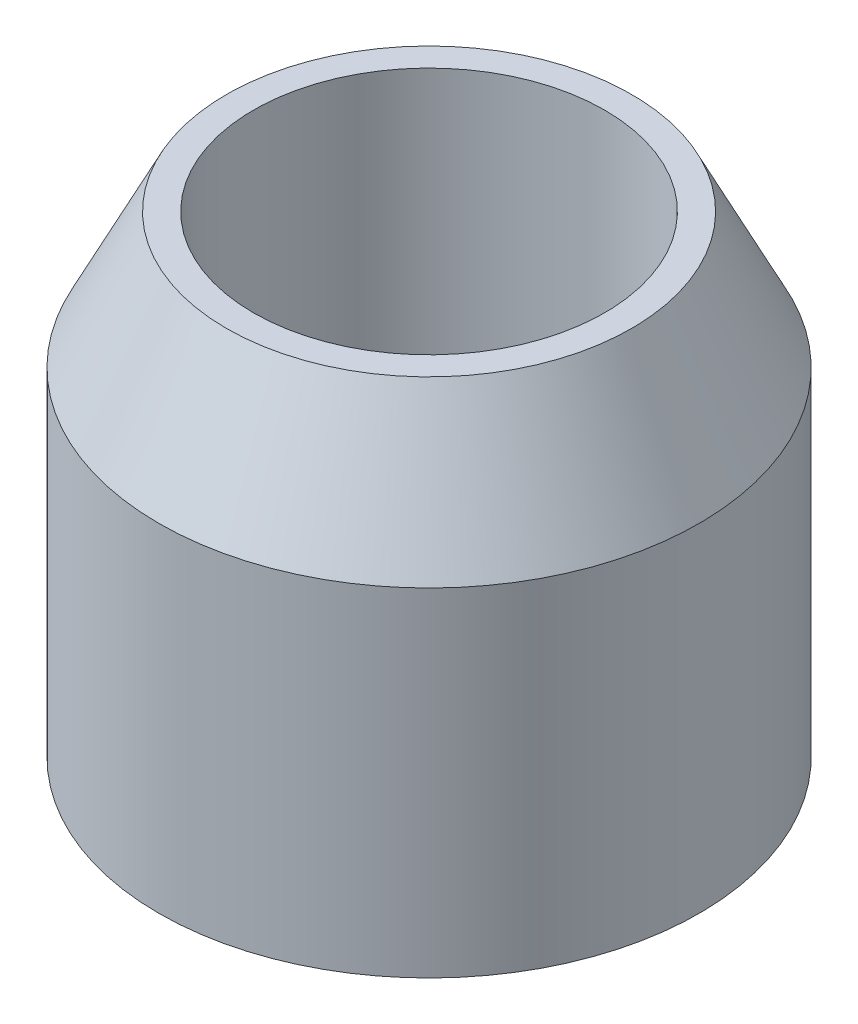
ISO-10303-21;
HEADER;
FILE_DESCRIPTION(('STEP AP214'),'2;1');
FILE_NAME('part.step','',(''),(''),'','','');
FILE_SCHEMA(('AUTOMOTIVE_DESIGN { 1 0 10303 214 1 1 1 1 }'));
ENDSEC;
DATA;
#1=APPLICATION_CONTEXT('core data for automotive mechanical design processes');
#2=APPLICATION_PROTOCOL_DEFINITION('international standard','automotive_design',2000,#1);
#3=PRODUCT_CONTEXT('',#1,'mechanical');
#4=PRODUCT('Part','Part','',(#3));
#5=PRODUCT_RELATED_PRODUCT_CATEGORY('part','',(#4));
#6=PRODUCT_DEFINITION_FORMATION('','',#4);
#7=PRODUCT_DEFINITION_CONTEXT('part definition',#1,'design');
#8=PRODUCT_DEFINITION('design','',#6,#7);
#9=PRODUCT_DEFINITION_SHAPE('','',#8);
#10=(LENGTH_UNIT() NAMED_UNIT(*) SI_UNIT(.MILLI.,.METRE.));
#11=(NAMED_UNIT(*) PLANE_ANGLE_UNIT() SI_UNIT($,.RADIAN.));
#12=(NAMED_UNIT(*) SI_UNIT($,.STERADIAN.) SOLID_ANGLE_UNIT());
#13=UNCERTAINTY_MEASURE_WITH_UNIT(LENGTH_MEASURE(1.E-05),#10,'distance_accuracy_value','');
#14=(GEOMETRIC_REPRESENTATION_CONTEXT(3) GLOBAL_UNCERTAINTY_ASSIGNED_CONTEXT((#13)) GLOBAL_UNIT_ASSIGNED_CONTEXT((#10,
#11,#12)) REPRESENTATION_CONTEXT('',''));
#15=CARTESIAN_POINT('',(0.,0.,0.));
#16=DIRECTION('',(0.,0.,1.));
#17=DIRECTION('',(1.,0.,0.));
#18=AXIS2_PLACEMENT_3D('',#15,#16,#17);
#19=CARTESIAN_POINT('',(0.,7.,0.));
#20=DIRECTION('',(0.,1.,0.));
#21=DIRECTION('',(0.,0.,1.));
#22=AXIS2_PLACEMENT_3D('',#19,#20,#21);
#23=PLANE('',#22);
#24=CARTESIAN_POINT('',(0.,7.,0.));
#25=DIRECTION('',(0.,1.,0.));
#26=DIRECTION('',(0.,0.,1.));
#27=AXIS2_PLACEMENT_3D('',#24,#25,#26);
#28=CIRCLE('',#27,3.);
#29=CARTESIAN_POINT('',(0.,7.,3.));
#30=VERTEX_POINT('',#29);
#31=EDGE_CURVE('E38',#30,#30,#28,.T.);
#32=ORIENTED_EDGE('',*,*,#31,.T.);
#33=EDGE_LOOP('',(#32));
#34=FACE_BOUND('',#33,.T.);
#35=CARTESIAN_POINT('',(0.,7.,0.));
#36=DIRECTION('',(0.,1.,0.));
#37=DIRECTION('',(0.,0.,1.));
#38=AXIS2_PLACEMENT_3D('',#35,#36,#37);
#39=CIRCLE('',#38,2.6);
#40=CARTESIAN_POINT('',(0.,7.,2.6));
#41=VERTEX_POINT('',#40);
#42=EDGE_CURVE('E46',#41,#41,#39,.T.);
#43=ORIENTED_EDGE('',*,*,#42,.F.);
#44=EDGE_LOOP('',(#43));
#45=FACE_BOUND('',#44,.T.);
#46=ADVANCED_FACE('F31',(#34,#45),#23,.T.);
#47=CARTESIAN_POINT('',(0.,0.,0.));
#48=DIRECTION('',(0.,1.,0.));
#49=DIRECTION('',(0.,0.,1.));
#50=AXIS2_PLACEMENT_3D('',#47,#48,#49);
#51=PLANE('',#50);
#52=CARTESIAN_POINT('',(0.,0.,0.));
#53=DIRECTION('',(0.,1.,0.));
#54=DIRECTION('',(0.,0.,1.));
#55=AXIS2_PLACEMENT_3D('',#52,#53,#54);
#56=CIRCLE('',#55,4.);
#57=CARTESIAN_POINT('',(0.,0.,4.));
#58=VERTEX_POINT('',#57);
#59=EDGE_CURVE('E42',#58,#58,#56,.T.);
#60=ORIENTED_EDGE('',*,*,#59,.F.);
#61=EDGE_LOOP('',(#60));
#62=FACE_BOUND('',#61,.T.);
#63=CARTESIAN_POINT('',(0.,0.,0.));
#64=DIRECTION('',(0.,1.,0.));
#65=DIRECTION('',(0.,0.,1.));
#66=AXIS2_PLACEMENT_3D('',#63,#64,#65);
#67=CIRCLE('',#66,2.6);
#68=CARTESIAN_POINT('',(0.,0.,2.6));
#69=VERTEX_POINT('',#68);
#70=EDGE_CURVE('E49',#69,#69,#67,.T.);
#71=ORIENTED_EDGE('',*,*,#70,.T.);
#72=EDGE_LOOP('',(#71));
#73=FACE_BOUND('',#72,.T.);
#74=ADVANCED_FACE('F59',(#62,#73),#51,.F.);
#75=CARTESIAN_POINT('',(0.,7.,0.));
#76=DIRECTION('',(0.,-1.,0.));
#77=DIRECTION('',(0.,0.,-1.));
#78=AXIS2_PLACEMENT_3D('',#75,#76,#77);
#79=CYLINDRICAL_SURFACE('',#78,4.);
#80=CARTESIAN_POINT('',(0.,4.99999999999999,0.));
#81=DIRECTION('',(0.,1.,0.));
#82=DIRECTION('',(0.,0.,1.));
#83=AXIS2_PLACEMENT_3D('',#80,#81,#82);
#84=CIRCLE('',#83,4.);
#85=CARTESIAN_POINT('',(0.,4.99999999999999,4.));
#86=VERTEX_POINT('',#85);
#87=EDGE_CURVE('E10',#86,#86,#84,.F.);
#88=ORIENTED_EDGE('',*,*,#87,.T.);
#89=EDGE_LOOP('',(#88));
#90=FACE_BOUND('',#89,.T.);
#91=ORIENTED_EDGE('',*,*,#59,.T.);
#92=EDGE_LOOP('',(#91));
#93=FACE_BOUND('',#92,.T.);
#94=ADVANCED_FACE('F64',(#90,#93),#79,.T.);
#95=CARTESIAN_POINT('',(0.,7.,0.));
#96=DIRECTION('',(0.,-1.,0.));
#97=DIRECTION('',(0.,0.,-1.));
#98=AXIS2_PLACEMENT_3D('',#95,#96,#97);
#99=CYLINDRICAL_SURFACE('',#98,2.6);
#100=ORIENTED_EDGE('',*,*,#42,.T.);
#101=EDGE_LOOP('',(#100));
#102=FACE_BOUND('',#101,.T.);
#103=ORIENTED_EDGE('',*,*,#70,.F.);
#104=EDGE_LOOP('',(#103));
#105=FACE_BOUND('',#104,.T.);
#106=ADVANCED_FACE('F55',(#102,#105),#99,.F.);
#107=CARTESIAN_POINT('',(0.,7.,0.));
#108=DIRECTION('',(0.,-1.,0.));
#109=DIRECTION('',(0.,0.,-1.));
#110=AXIS2_PLACEMENT_3D('',#107,#108,#109);
#111=CONICAL_SURFACE('',#110,3.,0.463647609000803);
#112=ORIENTED_EDGE('',*,*,#87,.F.);
#113=EDGE_LOOP('',(#112));
#114=FACE_BOUND('',#113,.T.);
#115=ORIENTED_EDGE('',*,*,#31,.F.);
#116=EDGE_LOOP('',(#115));
#117=FACE_BOUND('',#116,.T.);
#118=ADVANCED_FACE('F33',(#114,#117),#111,.T.);
#119=CLOSED_SHELL('',(#46,#74,#94,#106,#118));
#120=MANIFOLD_SOLID_BREP('B2',#119);
#121=ADVANCED_BREP_SHAPE_REPRESENTATION('',(#18,#120),#14);
#122=SHAPE_DEFINITION_REPRESENTATION(#9,#121);
ENDSEC;
END-ISO-10303-21;
